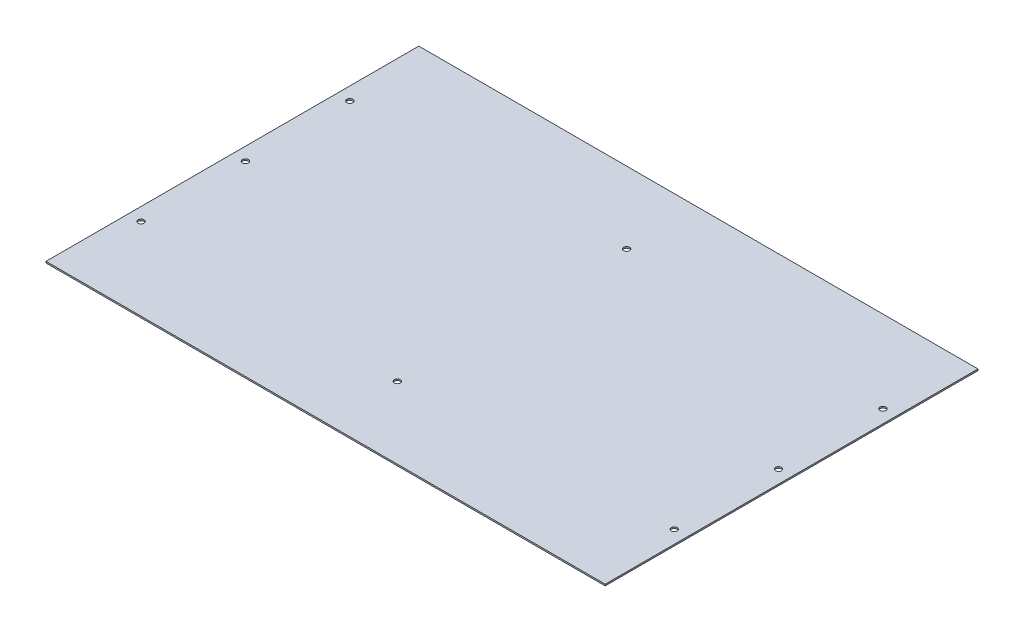
ISO-10303-21;
HEADER;
FILE_DESCRIPTION(('STEP AP214'),'2;1');
FILE_NAME('part.step','',(''),(''),'','','');
FILE_SCHEMA(('AUTOMOTIVE_DESIGN { 1 0 10303 214 1 1 1 1 }'));
ENDSEC;
DATA;
#1=APPLICATION_CONTEXT('core data for automotive mechanical design processes');
#2=APPLICATION_PROTOCOL_DEFINITION('international standard','automotive_design',2000,#1);
#3=PRODUCT_CONTEXT('',#1,'mechanical');
#4=PRODUCT('Part','Part','',(#3));
#5=PRODUCT_RELATED_PRODUCT_CATEGORY('part','',(#4));
#6=PRODUCT_DEFINITION_FORMATION('','',#4);
#7=PRODUCT_DEFINITION_CONTEXT('part definition',#1,'design');
#8=PRODUCT_DEFINITION('design','',#6,#7);
#9=PRODUCT_DEFINITION_SHAPE('','',#8);
#10=(LENGTH_UNIT() NAMED_UNIT(*) SI_UNIT(.MILLI.,.METRE.));
#11=(NAMED_UNIT(*) PLANE_ANGLE_UNIT() SI_UNIT($,.RADIAN.));
#12=(NAMED_UNIT(*) SI_UNIT($,.STERADIAN.) SOLID_ANGLE_UNIT());
#13=UNCERTAINTY_MEASURE_WITH_UNIT(LENGTH_MEASURE(1.E-05),#10,'distance_accuracy_value','');
#14=(GEOMETRIC_REPRESENTATION_CONTEXT(3) GLOBAL_UNCERTAINTY_ASSIGNED_CONTEXT((#13)) GLOBAL_UNIT_ASSIGNED_CONTEXT((#10,
#11,#12)) REPRESENTATION_CONTEXT('',''));
#15=CARTESIAN_POINT('',(0.,0.,0.));
#16=DIRECTION('',(0.,0.,1.));
#17=DIRECTION('',(1.,0.,0.));
#18=AXIS2_PLACEMENT_3D('',#15,#16,#17);
#19=CARTESIAN_POINT('',(375.,2.,-250.));
#20=DIRECTION('',(-1.,0.,0.));
#21=DIRECTION('',(0.,0.,1.));
#22=AXIS2_PLACEMENT_3D('',#19,#20,#21);
#23=PLANE('',#22);
#24=DIRECTION('',(0.,0.,-1.));
#25=VECTOR('',#24,1.);
#26=CARTESIAN_POINT('',(375.,0.,-250.));
#27=LINE('',#26,#25);
#28=CARTESIAN_POINT('',(375.,0.,250.));
#29=VERTEX_POINT('',#28);
#30=CARTESIAN_POINT('',(375.,0.,-250.));
#31=VERTEX_POINT('',#30);
#32=EDGE_CURVE('E95',#29,#31,#27,.T.);
#33=ORIENTED_EDGE('',*,*,#32,.T.);
#34=DIRECTION('',(0.,-1.,0.));
#35=VECTOR('',#34,1.);
#36=CARTESIAN_POINT('',(375.,2.,-250.));
#37=LINE('',#36,#35);
#38=CARTESIAN_POINT('',(375.,2.,-250.));
#39=VERTEX_POINT('',#38);
#40=EDGE_CURVE('E11',#39,#31,#37,.T.);
#41=ORIENTED_EDGE('',*,*,#40,.F.);
#42=DIRECTION('',(0.,0.,-1.));
#43=VECTOR('',#42,1.);
#44=CARTESIAN_POINT('',(375.,2.,-250.));
#45=LINE('',#44,#43);
#46=CARTESIAN_POINT('',(375.,2.,250.));
#47=VERTEX_POINT('',#46);
#48=EDGE_CURVE('E83',#47,#39,#45,.T.);
#49=ORIENTED_EDGE('',*,*,#48,.F.);
#50=DIRECTION('',(0.,-1.,0.));
#51=VECTOR('',#50,1.);
#52=CARTESIAN_POINT('',(375.,2.,250.));
#53=LINE('',#52,#51);
#54=EDGE_CURVE('E91',#47,#29,#53,.T.);
#55=ORIENTED_EDGE('',*,*,#54,.T.);
#56=EDGE_LOOP('',(#33,#41,#49,#55));
#57=FACE_BOUND('',#56,.T.);
#58=ADVANCED_FACE('F32',(#57),#23,.F.);
#59=CARTESIAN_POINT('',(-375.,2.,-250.));
#60=DIRECTION('',(0.,0.,1.));
#61=DIRECTION('',(1.,0.,0.));
#62=AXIS2_PLACEMENT_3D('',#59,#60,#61);
#63=PLANE('',#62);
#64=DIRECTION('',(-1.,0.,0.));
#65=VECTOR('',#64,1.);
#66=CARTESIAN_POINT('',(-375.,0.,-250.));
#67=LINE('',#66,#65);
#68=CARTESIAN_POINT('',(-375.,0.,-250.));
#69=VERTEX_POINT('',#68);
#70=EDGE_CURVE('E87',#31,#69,#67,.T.);
#71=ORIENTED_EDGE('',*,*,#70,.T.);
#72=DIRECTION('',(0.,-1.,0.));
#73=VECTOR('',#72,1.);
#74=CARTESIAN_POINT('',(-375.,2.,-250.));
#75=LINE('',#74,#73);
#76=CARTESIAN_POINT('',(-375.,2.,-250.));
#77=VERTEX_POINT('',#76);
#78=EDGE_CURVE('E40',#77,#69,#75,.T.);
#79=ORIENTED_EDGE('',*,*,#78,.F.);
#80=DIRECTION('',(-1.,0.,0.));
#81=VECTOR('',#80,1.);
#82=CARTESIAN_POINT('',(-375.,2.,-250.));
#83=LINE('',#82,#81);
#84=EDGE_CURVE('E78',#39,#77,#83,.T.);
#85=ORIENTED_EDGE('',*,*,#84,.F.);
#86=ORIENTED_EDGE('',*,*,#40,.T.);
#87=EDGE_LOOP('',(#71,#79,#85,#86));
#88=FACE_BOUND('',#87,.T.);
#89=ADVANCED_FACE('F86',(#88),#63,.F.);
#90=CARTESIAN_POINT('',(-375.,2.,-250.));
#91=DIRECTION('',(1.,0.,0.));
#92=DIRECTION('',(0.,0.,-1.));
#93=AXIS2_PLACEMENT_3D('',#90,#91,#92);
#94=PLANE('',#93);
#95=DIRECTION('',(0.,0.,1.));
#96=VECTOR('',#95,1.);
#97=CARTESIAN_POINT('',(-375.,0.,-250.));
#98=LINE('',#97,#96);
#99=CARTESIAN_POINT('',(-375.,0.,250.));
#100=VERTEX_POINT('',#99);
#101=EDGE_CURVE('E65',#69,#100,#98,.T.);
#102=ORIENTED_EDGE('',*,*,#101,.T.);
#103=DIRECTION('',(0.,-1.,0.));
#104=VECTOR('',#103,1.);
#105=CARTESIAN_POINT('',(-375.,2.,250.));
#106=LINE('',#105,#104);
#107=CARTESIAN_POINT('',(-375.,2.,250.));
#108=VERTEX_POINT('',#107);
#109=EDGE_CURVE('E88',#108,#100,#106,.T.);
#110=ORIENTED_EDGE('',*,*,#109,.F.);
#111=DIRECTION('',(0.,0.,1.));
#112=VECTOR('',#111,1.);
#113=CARTESIAN_POINT('',(-375.,2.,-250.));
#114=LINE('',#113,#112);
#115=EDGE_CURVE('E81',#77,#108,#114,.T.);
#116=ORIENTED_EDGE('',*,*,#115,.F.);
#117=ORIENTED_EDGE('',*,*,#78,.T.);
#118=EDGE_LOOP('',(#102,#110,#116,#117));
#119=FACE_BOUND('',#118,.T.);
#120=ADVANCED_FACE('F89',(#119),#94,.F.);
#121=CARTESIAN_POINT('',(-375.,2.,250.));
#122=DIRECTION('',(0.,0.,-1.));
#123=DIRECTION('',(-1.,0.,0.));
#124=AXIS2_PLACEMENT_3D('',#121,#122,#123);
#125=PLANE('',#124);
#126=DIRECTION('',(1.,0.,0.));
#127=VECTOR('',#126,1.);
#128=CARTESIAN_POINT('',(-375.,0.,250.));
#129=LINE('',#128,#127);
#130=EDGE_CURVE('E71',#100,#29,#129,.T.);
#131=ORIENTED_EDGE('',*,*,#130,.T.);
#132=ORIENTED_EDGE('',*,*,#54,.F.);
#133=DIRECTION('',(1.,0.,0.));
#134=VECTOR('',#133,1.);
#135=CARTESIAN_POINT('',(-375.,2.,250.));
#136=LINE('',#135,#134);
#137=EDGE_CURVE('E48',#108,#47,#136,.T.);
#138=ORIENTED_EDGE('',*,*,#137,.F.);
#139=ORIENTED_EDGE('',*,*,#109,.T.);
#140=EDGE_LOOP('',(#131,#132,#138,#139));
#141=FACE_BOUND('',#140,.T.);
#142=ADVANCED_FACE('F103',(#141),#125,.F.);
#143=CARTESIAN_POINT('',(0.,2.,0.));
#144=DIRECTION('',(0.,1.,0.));
#145=DIRECTION('',(0.,0.,1.));
#146=AXIS2_PLACEMENT_3D('',#143,#144,#145);
#147=PLANE('',#146);
#148=CARTESIAN_POINT('',(0.,2.,-153.75));
#149=DIRECTION('',(0.,1.,0.));
#150=DIRECTION('',(0.,0.,1.));
#151=AXIS2_PLACEMENT_3D('',#148,#149,#150);
#152=CIRCLE('',#151,4.);
#153=CARTESIAN_POINT('',(0.,2.,-149.75));
#154=VERTEX_POINT('',#153);
#155=EDGE_CURVE('E151',#154,#154,#152,.T.);
#156=ORIENTED_EDGE('',*,*,#155,.F.);
#157=EDGE_LOOP('',(#156));
#158=FACE_BOUND('',#157,.T.);
#159=CARTESIAN_POINT('',(0.,2.,153.75));
#160=DIRECTION('',(0.,1.,0.));
#161=DIRECTION('',(0.,0.,1.));
#162=AXIS2_PLACEMENT_3D('',#159,#160,#161);
#163=CIRCLE('',#162,4.);
#164=CARTESIAN_POINT('',(0.,2.,157.75));
#165=VERTEX_POINT('',#164);
#166=EDGE_CURVE('E145',#165,#165,#163,.T.);
#167=ORIENTED_EDGE('',*,*,#166,.F.);
#168=EDGE_LOOP('',(#167));
#169=FACE_BOUND('',#168,.T.);
#170=CARTESIAN_POINT('',(357.5,2.,140.));
#171=DIRECTION('',(0.,-1.,0.));
#172=DIRECTION('',(0.,0.,1.));
#173=AXIS2_PLACEMENT_3D('',#170,#171,#172);
#174=CIRCLE('',#173,3.99999999999999);
#175=CARTESIAN_POINT('',(357.5,2.,144.));
#176=VERTEX_POINT('',#175);
#177=EDGE_CURVE('E133',#176,#176,#174,.T.);
#178=ORIENTED_EDGE('',*,*,#177,.T.);
#179=EDGE_LOOP('',(#178));
#180=FACE_BOUND('',#179,.T.);
#181=CARTESIAN_POINT('',(357.5,2.,-140.));
#182=DIRECTION('',(0.,-1.,0.));
#183=DIRECTION('',(0.,0.,1.));
#184=AXIS2_PLACEMENT_3D('',#181,#182,#183);
#185=CIRCLE('',#184,3.99999999999999);
#186=CARTESIAN_POINT('',(357.5,2.,-136.));
#187=VERTEX_POINT('',#186);
#188=EDGE_CURVE('E140',#187,#187,#185,.T.);
#189=ORIENTED_EDGE('',*,*,#188,.T.);
#190=EDGE_LOOP('',(#189));
#191=FACE_BOUND('',#190,.T.);
#192=CARTESIAN_POINT('',(357.5,2.,-2.22044604925031E-13));
#193=DIRECTION('',(0.,-1.,0.));
#194=DIRECTION('',(0.,0.,1.));
#195=AXIS2_PLACEMENT_3D('',#192,#193,#194);
#196=CIRCLE('',#195,3.99999999999999);
#197=CARTESIAN_POINT('',(357.5,2.,3.99999999999977));
#198=VERTEX_POINT('',#197);
#199=EDGE_CURVE('E127',#198,#198,#196,.T.);
#200=ORIENTED_EDGE('',*,*,#199,.T.);
#201=EDGE_LOOP('',(#200));
#202=FACE_BOUND('',#201,.T.);
#203=CARTESIAN_POINT('',(-357.5,2.,140.));
#204=DIRECTION('',(0.,1.,0.));
#205=DIRECTION('',(0.,0.,1.));
#206=AXIS2_PLACEMENT_3D('',#203,#204,#205);
#207=CIRCLE('',#206,3.99999999999999);
#208=CARTESIAN_POINT('',(-357.5,2.,144.));
#209=VERTEX_POINT('',#208);
#210=EDGE_CURVE('E115',#209,#209,#207,.T.);
#211=ORIENTED_EDGE('',*,*,#210,.F.);
#212=EDGE_LOOP('',(#211));
#213=FACE_BOUND('',#212,.T.);
#214=CARTESIAN_POINT('',(-357.5,2.,-140.));
#215=DIRECTION('',(0.,1.,0.));
#216=DIRECTION('',(0.,0.,1.));
#217=AXIS2_PLACEMENT_3D('',#214,#215,#216);
#218=CIRCLE('',#217,3.99999999999999);
#219=CARTESIAN_POINT('',(-357.5,2.,-136.));
#220=VERTEX_POINT('',#219);
#221=EDGE_CURVE('E122',#220,#220,#218,.T.);
#222=ORIENTED_EDGE('',*,*,#221,.F.);
#223=EDGE_LOOP('',(#222));
#224=FACE_BOUND('',#223,.T.);
#225=CARTESIAN_POINT('',(-357.5,2.,-2.22044604925031E-13));
#226=DIRECTION('',(0.,1.,0.));
#227=DIRECTION('',(0.,0.,1.));
#228=AXIS2_PLACEMENT_3D('',#225,#226,#227);
#229=CIRCLE('',#228,3.99999999999999);
#230=CARTESIAN_POINT('',(-357.5,2.,3.99999999999977));
#231=VERTEX_POINT('',#230);
#232=EDGE_CURVE('E109',#231,#231,#229,.T.);
#233=ORIENTED_EDGE('',*,*,#232,.F.);
#234=EDGE_LOOP('',(#233));
#235=FACE_BOUND('',#234,.T.);
#236=ORIENTED_EDGE('',*,*,#48,.T.);
#237=ORIENTED_EDGE('',*,*,#84,.T.);
#238=ORIENTED_EDGE('',*,*,#115,.T.);
#239=ORIENTED_EDGE('',*,*,#137,.T.);
#240=EDGE_LOOP('',(#236,#237,#238,#239));
#241=FACE_BOUND('',#240,.T.);
#242=ADVANCED_FACE('F79',(#158,#169,#180,#191,#202,#213,#224,#235,#241),#147,.T.);
#243=CARTESIAN_POINT('',(0.,0.,0.));
#244=DIRECTION('',(0.,1.,0.));
#245=DIRECTION('',(0.,0.,1.));
#246=AXIS2_PLACEMENT_3D('',#243,#244,#245);
#247=PLANE('',#246);
#248=CARTESIAN_POINT('',(0.,0.,-153.75));
#249=DIRECTION('',(0.,1.,0.));
#250=DIRECTION('',(0.,0.,1.));
#251=AXIS2_PLACEMENT_3D('',#248,#249,#250);
#252=CIRCLE('',#251,4.);
#253=CARTESIAN_POINT('',(0.,0.,-149.75));
#254=VERTEX_POINT('',#253);
#255=EDGE_CURVE('E137',#254,#254,#252,.T.);
#256=ORIENTED_EDGE('',*,*,#255,.T.);
#257=EDGE_LOOP('',(#256));
#258=FACE_BOUND('',#257,.T.);
#259=CARTESIAN_POINT('',(0.,0.,153.75));
#260=DIRECTION('',(0.,1.,0.));
#261=DIRECTION('',(0.,0.,1.));
#262=AXIS2_PLACEMENT_3D('',#259,#260,#261);
#263=CIRCLE('',#262,4.);
#264=CARTESIAN_POINT('',(0.,0.,157.75));
#265=VERTEX_POINT('',#264);
#266=EDGE_CURVE('E148',#265,#265,#263,.T.);
#267=ORIENTED_EDGE('',*,*,#266,.T.);
#268=EDGE_LOOP('',(#267));
#269=FACE_BOUND('',#268,.T.);
#270=CARTESIAN_POINT('',(357.5,0.,140.));
#271=DIRECTION('',(0.,-1.,0.));
#272=DIRECTION('',(0.,0.,1.));
#273=AXIS2_PLACEMENT_3D('',#270,#271,#272);
#274=CIRCLE('',#273,3.99999999999999);
#275=CARTESIAN_POINT('',(357.5,0.,144.));
#276=VERTEX_POINT('',#275);
#277=EDGE_CURVE('E136',#276,#276,#274,.T.);
#278=ORIENTED_EDGE('',*,*,#277,.F.);
#279=EDGE_LOOP('',(#278));
#280=FACE_BOUND('',#279,.T.);
#281=CARTESIAN_POINT('',(357.5,0.,-140.));
#282=DIRECTION('',(0.,-1.,0.));
#283=DIRECTION('',(0.,0.,1.));
#284=AXIS2_PLACEMENT_3D('',#281,#282,#283);
#285=CIRCLE('',#284,3.99999999999999);
#286=CARTESIAN_POINT('',(357.5,0.,-136.));
#287=VERTEX_POINT('',#286);
#288=EDGE_CURVE('E130',#287,#287,#285,.T.);
#289=ORIENTED_EDGE('',*,*,#288,.F.);
#290=EDGE_LOOP('',(#289));
#291=FACE_BOUND('',#290,.T.);
#292=CARTESIAN_POINT('',(357.5,0.,-2.22044604925031E-13));
#293=DIRECTION('',(0.,-1.,0.));
#294=DIRECTION('',(0.,0.,1.));
#295=AXIS2_PLACEMENT_3D('',#292,#293,#294);
#296=CIRCLE('',#295,3.99999999999999);
#297=CARTESIAN_POINT('',(357.5,0.,3.99999999999977));
#298=VERTEX_POINT('',#297);
#299=EDGE_CURVE('E119',#298,#298,#296,.T.);
#300=ORIENTED_EDGE('',*,*,#299,.F.);
#301=EDGE_LOOP('',(#300));
#302=FACE_BOUND('',#301,.T.);
#303=CARTESIAN_POINT('',(-357.5,0.,140.));
#304=DIRECTION('',(0.,1.,0.));
#305=DIRECTION('',(0.,0.,1.));
#306=AXIS2_PLACEMENT_3D('',#303,#304,#305);
#307=CIRCLE('',#306,3.99999999999999);
#308=CARTESIAN_POINT('',(-357.5,0.,144.));
#309=VERTEX_POINT('',#308);
#310=EDGE_CURVE('E118',#309,#309,#307,.T.);
#311=ORIENTED_EDGE('',*,*,#310,.T.);
#312=EDGE_LOOP('',(#311));
#313=FACE_BOUND('',#312,.T.);
#314=CARTESIAN_POINT('',(-357.5,0.,-140.));
#315=DIRECTION('',(0.,1.,0.));
#316=DIRECTION('',(0.,0.,1.));
#317=AXIS2_PLACEMENT_3D('',#314,#315,#316);
#318=CIRCLE('',#317,3.99999999999999);
#319=CARTESIAN_POINT('',(-357.5,0.,-136.));
#320=VERTEX_POINT('',#319);
#321=EDGE_CURVE('E112',#320,#320,#318,.T.);
#322=ORIENTED_EDGE('',*,*,#321,.T.);
#323=EDGE_LOOP('',(#322));
#324=FACE_BOUND('',#323,.T.);
#325=CARTESIAN_POINT('',(-357.5,0.,-2.22044604925031E-13));
#326=DIRECTION('',(0.,1.,0.));
#327=DIRECTION('',(0.,0.,1.));
#328=AXIS2_PLACEMENT_3D('',#325,#326,#327);
#329=CIRCLE('',#328,3.99999999999999);
#330=CARTESIAN_POINT('',(-357.5,0.,3.99999999999977));
#331=VERTEX_POINT('',#330);
#332=EDGE_CURVE('E98',#331,#331,#329,.T.);
#333=ORIENTED_EDGE('',*,*,#332,.T.);
#334=EDGE_LOOP('',(#333));
#335=FACE_BOUND('',#334,.T.);
#336=ORIENTED_EDGE('',*,*,#32,.F.);
#337=ORIENTED_EDGE('',*,*,#130,.F.);
#338=ORIENTED_EDGE('',*,*,#101,.F.);
#339=ORIENTED_EDGE('',*,*,#70,.F.);
#340=EDGE_LOOP('',(#336,#337,#338,#339));
#341=FACE_BOUND('',#340,.T.);
#342=ADVANCED_FACE('F106',(#258,#269,#280,#291,#302,#313,#324,#335,#341),#247,.F.);
#343=CARTESIAN_POINT('',(-357.5,0.,-2.22044604925031E-13));
#344=DIRECTION('',(0.,1.,0.));
#345=DIRECTION('',(0.,0.,1.));
#346=AXIS2_PLACEMENT_3D('',#343,#344,#345);
#347=CYLINDRICAL_SURFACE('',#346,3.99999999999999);
#348=ORIENTED_EDGE('',*,*,#332,.F.);
#349=EDGE_LOOP('',(#348));
#350=FACE_BOUND('',#349,.T.);
#351=ORIENTED_EDGE('',*,*,#232,.T.);
#352=EDGE_LOOP('',(#351));
#353=FACE_BOUND('',#352,.T.);
#354=ADVANCED_FACE('F183',(#350,#353),#347,.F.);
#355=CARTESIAN_POINT('',(-357.5,0.,-140.));
#356=DIRECTION('',(0.,1.,0.));
#357=DIRECTION('',(0.,0.,1.));
#358=AXIS2_PLACEMENT_3D('',#355,#356,#357);
#359=CYLINDRICAL_SURFACE('',#358,3.99999999999999);
#360=ORIENTED_EDGE('',*,*,#321,.F.);
#361=EDGE_LOOP('',(#360));
#362=FACE_BOUND('',#361,.T.);
#363=ORIENTED_EDGE('',*,*,#221,.T.);
#364=EDGE_LOOP('',(#363));
#365=FACE_BOUND('',#364,.T.);
#366=ADVANCED_FACE('F185',(#362,#365),#359,.F.);
#367=CARTESIAN_POINT('',(-357.5,0.,140.));
#368=DIRECTION('',(0.,1.,0.));
#369=DIRECTION('',(0.,0.,1.));
#370=AXIS2_PLACEMENT_3D('',#367,#368,#369);
#371=CYLINDRICAL_SURFACE('',#370,3.99999999999999);
#372=ORIENTED_EDGE('',*,*,#310,.F.);
#373=EDGE_LOOP('',(#372));
#374=FACE_BOUND('',#373,.T.);
#375=ORIENTED_EDGE('',*,*,#210,.T.);
#376=EDGE_LOOP('',(#375));
#377=FACE_BOUND('',#376,.T.);
#378=ADVANCED_FACE('F192',(#374,#377),#371,.F.);
#379=CARTESIAN_POINT('',(357.5,0.,-2.22044604925031E-13));
#380=DIRECTION('',(0.,1.,0.));
#381=DIRECTION('',(0.,0.,1.));
#382=AXIS2_PLACEMENT_3D('',#379,#380,#381);
#383=CYLINDRICAL_SURFACE('',#382,3.99999999999999);
#384=ORIENTED_EDGE('',*,*,#299,.T.);
#385=EDGE_LOOP('',(#384));
#386=FACE_BOUND('',#385,.T.);
#387=ORIENTED_EDGE('',*,*,#199,.F.);
#388=EDGE_LOOP('',(#387));
#389=FACE_BOUND('',#388,.T.);
#390=ADVANCED_FACE('F255',(#386,#389),#383,.F.);
#391=CARTESIAN_POINT('',(357.5,0.,-140.));
#392=DIRECTION('',(0.,1.,0.));
#393=DIRECTION('',(0.,0.,1.));
#394=AXIS2_PLACEMENT_3D('',#391,#392,#393);
#395=CYLINDRICAL_SURFACE('',#394,3.99999999999999);
#396=ORIENTED_EDGE('',*,*,#288,.T.);
#397=EDGE_LOOP('',(#396));
#398=FACE_BOUND('',#397,.T.);
#399=ORIENTED_EDGE('',*,*,#188,.F.);
#400=EDGE_LOOP('',(#399));
#401=FACE_BOUND('',#400,.T.);
#402=ADVANCED_FACE('F248',(#398,#401),#395,.F.);
#403=CARTESIAN_POINT('',(357.5,0.,140.));
#404=DIRECTION('',(0.,1.,0.));
#405=DIRECTION('',(0.,0.,1.));
#406=AXIS2_PLACEMENT_3D('',#403,#404,#405);
#407=CYLINDRICAL_SURFACE('',#406,3.99999999999999);
#408=ORIENTED_EDGE('',*,*,#277,.T.);
#409=EDGE_LOOP('',(#408));
#410=FACE_BOUND('',#409,.T.);
#411=ORIENTED_EDGE('',*,*,#177,.F.);
#412=EDGE_LOOP('',(#411));
#413=FACE_BOUND('',#412,.T.);
#414=ADVANCED_FACE('F233',(#410,#413),#407,.F.);
#415=CARTESIAN_POINT('',(0.,0.,153.75));
#416=DIRECTION('',(0.,1.,0.));
#417=DIRECTION('',(0.,0.,1.));
#418=AXIS2_PLACEMENT_3D('',#415,#416,#417);
#419=CYLINDRICAL_SURFACE('',#418,4.);
#420=ORIENTED_EDGE('',*,*,#266,.F.);
#421=EDGE_LOOP('',(#420));
#422=FACE_BOUND('',#421,.T.);
#423=ORIENTED_EDGE('',*,*,#166,.T.);
#424=EDGE_LOOP('',(#423));
#425=FACE_BOUND('',#424,.T.);
#426=ADVANCED_FACE('F162',(#422,#425),#419,.F.);
#427=CARTESIAN_POINT('',(0.,0.,-153.75));
#428=DIRECTION('',(0.,1.,0.));
#429=DIRECTION('',(0.,0.,1.));
#430=AXIS2_PLACEMENT_3D('',#427,#428,#429);
#431=CYLINDRICAL_SURFACE('',#430,4.);
#432=ORIENTED_EDGE('',*,*,#255,.F.);
#433=EDGE_LOOP('',(#432));
#434=FACE_BOUND('',#433,.T.);
#435=ORIENTED_EDGE('',*,*,#155,.T.);
#436=EDGE_LOOP('',(#435));
#437=FACE_BOUND('',#436,.T.);
#438=ADVANCED_FACE('F159',(#434,#437),#431,.F.);
#439=CLOSED_SHELL('',(#58,#89,#120,#142,#242,#342,#354,#366,#378,#390,#402,#414,#426,#438));
#440=MANIFOLD_SOLID_BREP('B2',#439);
#441=ADVANCED_BREP_SHAPE_REPRESENTATION('',(#18,#440),#14);
#442=SHAPE_DEFINITION_REPRESENTATION(#9,#441);
ENDSEC;
END-ISO-10303-21;
